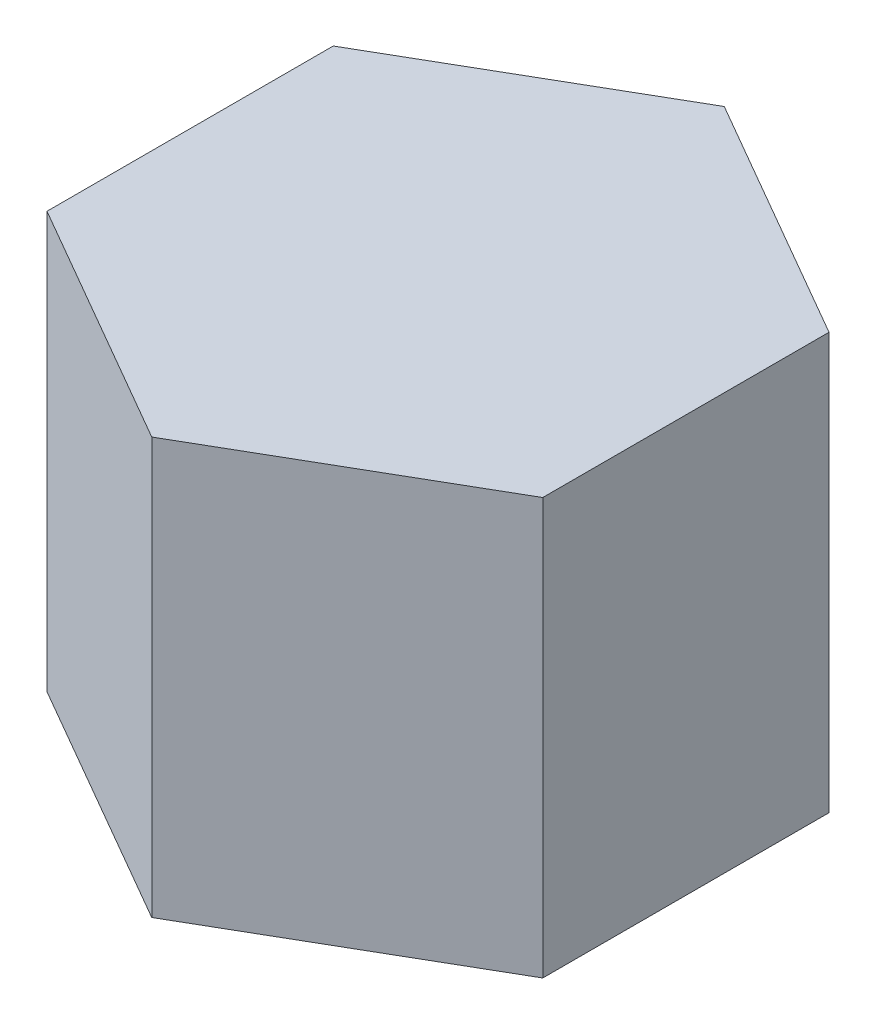
ISO-10303-21;
HEADER;
FILE_DESCRIPTION(('STEP AP214'),'2;1');
FILE_NAME('part.step','',(''),(''),'','','');
FILE_SCHEMA(('AUTOMOTIVE_DESIGN { 1 0 10303 214 1 1 1 1 }'));
ENDSEC;
DATA;
#1=APPLICATION_CONTEXT('core data for automotive mechanical design processes');
#2=APPLICATION_PROTOCOL_DEFINITION('international standard','automotive_design',2000,#1);
#3=PRODUCT_CONTEXT('',#1,'mechanical');
#4=PRODUCT('Part','Part','',(#3));
#5=PRODUCT_RELATED_PRODUCT_CATEGORY('part','',(#4));
#6=PRODUCT_DEFINITION_FORMATION('','',#4);
#7=PRODUCT_DEFINITION_CONTEXT('part definition',#1,'design');
#8=PRODUCT_DEFINITION('design','',#6,#7);
#9=PRODUCT_DEFINITION_SHAPE('','',#8);
#10=(LENGTH_UNIT() NAMED_UNIT(*) SI_UNIT(.MILLI.,.METRE.));
#11=(NAMED_UNIT(*) PLANE_ANGLE_UNIT() SI_UNIT($,.RADIAN.));
#12=(NAMED_UNIT(*) SI_UNIT($,.STERADIAN.) SOLID_ANGLE_UNIT());
#13=UNCERTAINTY_MEASURE_WITH_UNIT(LENGTH_MEASURE(1.E-05),#10,'distance_accuracy_value','');
#14=(GEOMETRIC_REPRESENTATION_CONTEXT(3) GLOBAL_UNCERTAINTY_ASSIGNED_CONTEXT((#13)) GLOBAL_UNIT_ASSIGNED_CONTEXT((#10,
#11,#12)) REPRESENTATION_CONTEXT('',''));
#15=CARTESIAN_POINT('',(0.,0.,0.));
#16=DIRECTION('',(0.,0.,1.));
#17=DIRECTION('',(1.,0.,0.));
#18=AXIS2_PLACEMENT_3D('',#15,#16,#17);
#19=CARTESIAN_POINT('',(201.839551417382,-147.556598747966,287.351844201572));
#20=DIRECTION('',(-0.499999999999943,0.,-0.866025403784471));
#21=DIRECTION('',(-0.866025403784471,0.,0.499999999999943));
#22=AXIS2_PLACEMENT_3D('',#19,#20,#21);
#23=PLANE('',#22);
#24=CARTESIAN_POINT('',(202.142660308706,-147.047793579175,287.176844201572));
#25=DIRECTION('',(-0.866025403784471,0.,0.499999999999943));
#26=VECTOR('',#25,1.);
#27=LINE('',#24,#26);
#28=CARTESIAN_POINT('',(202.142660308706,-147.047793579175,287.176844201572));
#29=VERTEX_POINT('',#28);
#30=CARTESIAN_POINT('',(201.839551417382,-147.047793579175,287.351844201572));
#31=VERTEX_POINT('',#30);
#32=EDGE_CURVE('E170',#29,#31,#27,.T.);
#33=ORIENTED_EDGE('',*,*,#32,.T.);
#34=CARTESIAN_POINT('',(201.839551417382,-147.556598747966,287.351844201572));
#35=DIRECTION('',(0.,1.,0.));
#36=VECTOR('',#35,1.);
#37=LINE('',#34,#36);
#38=CARTESIAN_POINT('',(201.839551417382,-147.556598747966,287.351844201572));
#39=VERTEX_POINT('',#38);
#40=EDGE_CURVE('E35',#39,#31,#37,.T.);
#41=ORIENTED_EDGE('',*,*,#40,.F.);
#42=CARTESIAN_POINT('',(202.142660308706,-147.556598747966,287.176844201572));
#43=DIRECTION('',(-0.866025403784471,0.,0.499999999999943));
#44=VECTOR('',#43,1.);
#45=LINE('',#42,#44);
#46=CARTESIAN_POINT('',(202.142660308706,-147.556598747966,287.176844201572));
#47=VERTEX_POINT('',#46);
#48=EDGE_CURVE('E159',#47,#39,#45,.T.);
#49=ORIENTED_EDGE('',*,*,#48,.F.);
#50=CARTESIAN_POINT('',(202.142660308706,-147.556598747966,287.176844201572));
#51=DIRECTION('',(0.,1.,0.));
#52=VECTOR('',#51,1.);
#53=LINE('',#50,#52);
#54=EDGE_CURVE('E10',#47,#29,#53,.T.);
#55=ORIENTED_EDGE('',*,*,#54,.T.);
#56=EDGE_LOOP('',(#33,#41,#49,#55));
#57=FACE_BOUND('',#56,.T.);
#58=ADVANCED_FACE('F16',(#57),#23,.F.);
#59=CARTESIAN_POINT('',(202.142660308706,-147.556598747966,291.594471220494));
#60=DIRECTION('',(-1.,0.,0.));
#61=DIRECTION('',(0.,-1.,0.));
#62=AXIS2_PLACEMENT_3D('',#59,#60,#61);
#63=PLANE('',#62);
#64=CARTESIAN_POINT('',(202.142660308706,-147.047793579175,286.826844201572));
#65=DIRECTION('',(0.,0.,1.));
#66=VECTOR('',#65,1.);
#67=LINE('',#64,#66);
#68=CARTESIAN_POINT('',(202.142660308706,-147.047793579175,286.826844201572));
#69=VERTEX_POINT('',#68);
#70=EDGE_CURVE('E167',#69,#29,#67,.T.);
#71=ORIENTED_EDGE('',*,*,#70,.T.);
#72=ORIENTED_EDGE('',*,*,#54,.F.);
#73=CARTESIAN_POINT('',(202.142660308706,-147.556598747966,286.826844201572));
#74=DIRECTION('',(0.,0.,1.));
#75=VECTOR('',#74,1.);
#76=LINE('',#73,#75);
#77=CARTESIAN_POINT('',(202.142660308706,-147.556598747966,286.826844201572));
#78=VERTEX_POINT('',#77);
#79=EDGE_CURVE('E156',#78,#47,#76,.T.);
#80=ORIENTED_EDGE('',*,*,#79,.F.);
#81=CARTESIAN_POINT('',(202.142660308706,-147.556598747966,286.826844201572));
#82=DIRECTION('',(0.,1.,0.));
#83=VECTOR('',#82,1.);
#84=LINE('',#81,#83);
#85=EDGE_CURVE('E27',#78,#69,#84,.T.);
#86=ORIENTED_EDGE('',*,*,#85,.T.);
#87=EDGE_LOOP('',(#71,#72,#80,#86));
#88=FACE_BOUND('',#87,.T.);
#89=ADVANCED_FACE('F189',(#88),#63,.F.);
#90=CARTESIAN_POINT('',(202.142660308706,-147.556598747966,286.826844201572));
#91=DIRECTION('',(-0.499999999999943,0.,0.866025403784471));
#92=DIRECTION('',(0.866025403784471,0.,0.499999999999943));
#93=AXIS2_PLACEMENT_3D('',#90,#91,#92);
#94=PLANE('',#93);
#95=CARTESIAN_POINT('',(201.839551417381,-147.047793579175,286.651844201572));
#96=DIRECTION('',(0.866025403784471,0.,0.499999999999943));
#97=VECTOR('',#96,1.);
#98=LINE('',#95,#97);
#99=CARTESIAN_POINT('',(201.839551417382,-147.047793579175,286.651844201572));
#100=VERTEX_POINT('',#99);
#101=EDGE_CURVE('E163',#100,#69,#98,.T.);
#102=ORIENTED_EDGE('',*,*,#101,.T.);
#103=ORIENTED_EDGE('',*,*,#85,.F.);
#104=CARTESIAN_POINT('',(201.839551417381,-147.556598747966,286.651844201572));
#105=DIRECTION('',(0.866025403784471,0.,0.499999999999943));
#106=VECTOR('',#105,1.);
#107=LINE('',#104,#106);
#108=CARTESIAN_POINT('',(201.839551417382,-147.556598747966,286.651844201572));
#109=VERTEX_POINT('',#108);
#110=EDGE_CURVE('E106',#109,#78,#107,.T.);
#111=ORIENTED_EDGE('',*,*,#110,.F.);
#112=CARTESIAN_POINT('',(201.839551417381,-147.556598747966,286.651844201572));
#113=DIRECTION('',(0.,1.,0.));
#114=VECTOR('',#113,1.);
#115=LINE('',#112,#114);
#116=EDGE_CURVE('E94',#109,#100,#115,.T.);
#117=ORIENTED_EDGE('',*,*,#116,.T.);
#118=EDGE_LOOP('',(#102,#103,#111,#117));
#119=FACE_BOUND('',#118,.T.);
#120=ADVANCED_FACE('F198',(#119),#94,.F.);
#121=CARTESIAN_POINT('',(201.839551417382,-147.556598747966,286.651844201572));
#122=DIRECTION('',(0.500000000000096,0.,0.866025403784383));
#123=DIRECTION('',(0.866025403784383,0.,-0.500000000000096));
#124=AXIS2_PLACEMENT_3D('',#121,#122,#123);
#125=PLANE('',#124);
#126=CARTESIAN_POINT('',(201.536442526057,-147.047793579175,286.826844201572));
#127=DIRECTION('',(0.866025403784383,0.,-0.500000000000096));
#128=VECTOR('',#127,1.);
#129=LINE('',#126,#128);
#130=CARTESIAN_POINT('',(201.536442526057,-147.047793579175,286.826844201572));
#131=VERTEX_POINT('',#130);
#132=EDGE_CURVE('E162',#131,#100,#129,.T.);
#133=ORIENTED_EDGE('',*,*,#132,.T.);
#134=ORIENTED_EDGE('',*,*,#116,.F.);
#135=CARTESIAN_POINT('',(201.536442526057,-147.556598747966,286.826844201572));
#136=DIRECTION('',(0.866025403784383,0.,-0.500000000000096));
#137=VECTOR('',#136,1.);
#138=LINE('',#135,#137);
#139=CARTESIAN_POINT('',(201.536442526057,-147.556598747966,286.826844201572));
#140=VERTEX_POINT('',#139);
#141=EDGE_CURVE('E98',#140,#109,#138,.T.);
#142=ORIENTED_EDGE('',*,*,#141,.F.);
#143=CARTESIAN_POINT('',(201.536442526057,-147.556598747966,286.826844201572));
#144=DIRECTION('',(0.,1.,0.));
#145=VECTOR('',#144,1.);
#146=LINE('',#143,#145);
#147=EDGE_CURVE('E79',#140,#131,#146,.T.);
#148=ORIENTED_EDGE('',*,*,#147,.T.);
#149=EDGE_LOOP('',(#133,#134,#142,#148));
#150=FACE_BOUND('',#149,.T.);
#151=ADVANCED_FACE('F100',(#150),#125,.F.);
#152=CARTESIAN_POINT('',(201.536442526057,-147.556598747966,291.594471220494));
#153=DIRECTION('',(1.,0.,0.));
#154=DIRECTION('',(0.,1.,0.));
#155=AXIS2_PLACEMENT_3D('',#152,#153,#154);
#156=PLANE('',#155);
#157=CARTESIAN_POINT('',(201.536442526057,-147.047793579175,287.176844201572));
#158=DIRECTION('',(0.,0.,-1.));
#159=VECTOR('',#158,1.);
#160=LINE('',#157,#159);
#161=CARTESIAN_POINT('',(201.536442526057,-147.047793579175,287.176844201572));
#162=VERTEX_POINT('',#161);
#163=EDGE_CURVE('E88',#162,#131,#160,.T.);
#164=ORIENTED_EDGE('',*,*,#163,.T.);
#165=ORIENTED_EDGE('',*,*,#147,.F.);
#166=CARTESIAN_POINT('',(201.536442526057,-147.556598747966,287.176844201572));
#167=DIRECTION('',(0.,0.,-1.));
#168=VECTOR('',#167,1.);
#169=LINE('',#166,#168);
#170=CARTESIAN_POINT('',(201.536442526057,-147.556598747966,287.176844201572));
#171=VERTEX_POINT('',#170);
#172=EDGE_CURVE('E84',#171,#140,#169,.T.);
#173=ORIENTED_EDGE('',*,*,#172,.F.);
#174=CARTESIAN_POINT('',(201.536442526057,-147.556598747966,287.176844201572));
#175=DIRECTION('',(0.,1.,0.));
#176=VECTOR('',#175,1.);
#177=LINE('',#174,#176);
#178=EDGE_CURVE('E58',#171,#162,#177,.T.);
#179=ORIENTED_EDGE('',*,*,#178,.T.);
#180=EDGE_LOOP('',(#164,#165,#173,#179));
#181=FACE_BOUND('',#180,.T.);
#182=ADVANCED_FACE('F82',(#181),#156,.F.);
#183=CARTESIAN_POINT('',(201.536442526057,-147.556598747966,287.176844201572));
#184=DIRECTION('',(0.499999999999943,0.,-0.866025403784471));
#185=DIRECTION('',(-0.866025403784471,0.,-0.499999999999943));
#186=AXIS2_PLACEMENT_3D('',#183,#184,#185);
#187=PLANE('',#186);
#188=CARTESIAN_POINT('',(201.839551417382,-147.047793579175,287.351844201572));
#189=DIRECTION('',(-0.866025403784471,0.,-0.499999999999943));
#190=VECTOR('',#189,1.);
#191=LINE('',#188,#190);
#192=EDGE_CURVE('E160',#31,#162,#191,.T.);
#193=ORIENTED_EDGE('',*,*,#192,.T.);
#194=ORIENTED_EDGE('',*,*,#178,.F.);
#195=CARTESIAN_POINT('',(201.839551417382,-147.556598747966,287.351844201572));
#196=DIRECTION('',(-0.866025403784471,0.,-0.499999999999943));
#197=VECTOR('',#196,1.);
#198=LINE('',#195,#197);
#199=EDGE_CURVE('E112',#39,#171,#198,.T.);
#200=ORIENTED_EDGE('',*,*,#199,.F.);
#201=ORIENTED_EDGE('',*,*,#40,.T.);
#202=EDGE_LOOP('',(#193,#194,#200,#201));
#203=FACE_BOUND('',#202,.T.);
#204=ADVANCED_FACE('F131',(#203),#187,.F.);
#205=CARTESIAN_POINT('',(206.491105863044,-147.556598747966,291.594471220494));
#206=DIRECTION('',(0.,1.,0.));
#207=DIRECTION('',(-1.,0.,0.));
#208=AXIS2_PLACEMENT_3D('',#205,#206,#207);
#209=PLANE('',#208);
#210=ORIENTED_EDGE('',*,*,#48,.T.);
#211=ORIENTED_EDGE('',*,*,#199,.T.);
#212=ORIENTED_EDGE('',*,*,#172,.T.);
#213=ORIENTED_EDGE('',*,*,#141,.T.);
#214=ORIENTED_EDGE('',*,*,#110,.T.);
#215=ORIENTED_EDGE('',*,*,#79,.T.);
#216=EDGE_LOOP('',(#210,#211,#212,#213,#214,#215));
#217=FACE_BOUND('',#216,.T.);
#218=ADVANCED_FACE('F111',(#217),#209,.F.);
#219=CARTESIAN_POINT('',(206.491105863044,-147.047793579175,291.594471220494));
#220=DIRECTION('',(0.,1.,0.));
#221=DIRECTION('',(-1.,0.,0.));
#222=AXIS2_PLACEMENT_3D('',#219,#220,#221);
#223=PLANE('',#222);
#224=ORIENTED_EDGE('',*,*,#32,.F.);
#225=ORIENTED_EDGE('',*,*,#70,.F.);
#226=ORIENTED_EDGE('',*,*,#101,.F.);
#227=ORIENTED_EDGE('',*,*,#132,.F.);
#228=ORIENTED_EDGE('',*,*,#163,.F.);
#229=ORIENTED_EDGE('',*,*,#192,.F.);
#230=EDGE_LOOP('',(#224,#225,#226,#227,#228,#229));
#231=FACE_BOUND('',#230,.T.);
#232=ADVANCED_FACE('F130',(#231),#223,.T.);
#233=CLOSED_SHELL('',(#58,#89,#120,#151,#182,#204,#218,#232));
#234=MANIFOLD_SOLID_BREP('B1',#233);
#235=ADVANCED_BREP_SHAPE_REPRESENTATION('',(#18,#234),#14);
#236=SHAPE_DEFINITION_REPRESENTATION(#9,#235);
ENDSEC;
END-ISO-10303-21;
